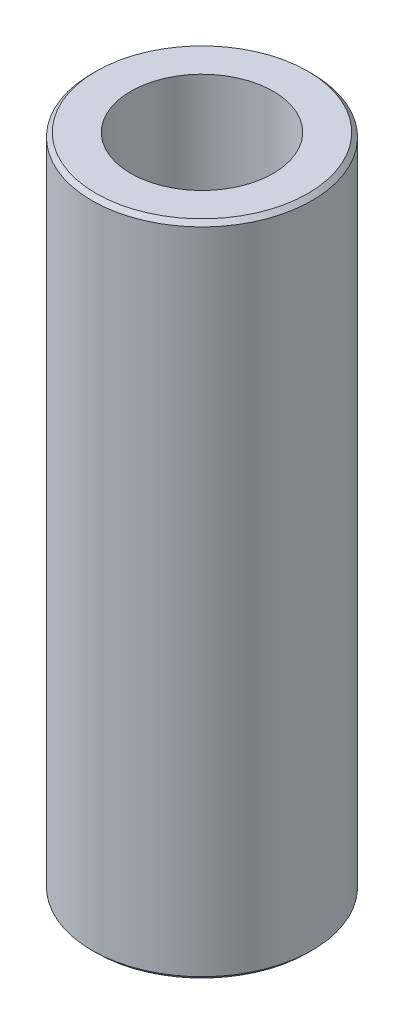
ISO-10303-21;
HEADER;
FILE_DESCRIPTION(('STEP AP214'),'2;1');
FILE_NAME('part.step','',(''),(''),'','','');
FILE_SCHEMA(('AUTOMOTIVE_DESIGN { 1 0 10303 214 1 1 1 1 }'));
ENDSEC;
DATA;
#1=APPLICATION_CONTEXT('core data for automotive mechanical design processes');
#2=APPLICATION_PROTOCOL_DEFINITION('international standard','automotive_design',2000,#1);
#3=PRODUCT_CONTEXT('',#1,'mechanical');
#4=PRODUCT('Part','Part','',(#3));
#5=PRODUCT_RELATED_PRODUCT_CATEGORY('part','',(#4));
#6=PRODUCT_DEFINITION_FORMATION('','',#4);
#7=PRODUCT_DEFINITION_CONTEXT('part definition',#1,'design');
#8=PRODUCT_DEFINITION('design','',#6,#7);
#9=PRODUCT_DEFINITION_SHAPE('','',#8);
#10=(LENGTH_UNIT() NAMED_UNIT(*) SI_UNIT(.MILLI.,.METRE.));
#11=(NAMED_UNIT(*) PLANE_ANGLE_UNIT() SI_UNIT($,.RADIAN.));
#12=(NAMED_UNIT(*) SI_UNIT($,.STERADIAN.) SOLID_ANGLE_UNIT());
#13=UNCERTAINTY_MEASURE_WITH_UNIT(LENGTH_MEASURE(1.E-05),#10,'distance_accuracy_value','');
#14=(GEOMETRIC_REPRESENTATION_CONTEXT(3) GLOBAL_UNCERTAINTY_ASSIGNED_CONTEXT((#13)) GLOBAL_UNIT_ASSIGNED_CONTEXT((#10,
#11,#12)) REPRESENTATION_CONTEXT('',''));
#15=CARTESIAN_POINT('',(0.,0.,0.));
#16=DIRECTION('',(0.,0.,1.));
#17=DIRECTION('',(1.,0.,0.));
#18=AXIS2_PLACEMENT_3D('',#15,#16,#17);
#19=CARTESIAN_POINT('',(0.,104.592380713921,0.));
#20=DIRECTION('',(0.,-1.,0.));
#21=DIRECTION('',(0.,0.,-1.));
#22=AXIS2_PLACEMENT_3D('',#19,#20,#21);
#23=CYLINDRICAL_SURFACE('',#22,17.5);
#24=CARTESIAN_POINT('',(0.,103.935720958625,0.));
#25=DIRECTION('',(0.,1.,0.));
#26=DIRECTION('',(0.,0.,1.));
#27=AXIS2_PLACEMENT_3D('',#24,#25,#26);
#28=CIRCLE('',#27,17.5);
#29=CARTESIAN_POINT('',(0.,103.935720958625,17.5));
#30=VERTEX_POINT('',#29);
#31=EDGE_CURVE('E50',#30,#30,#28,.F.);
#32=ORIENTED_EDGE('',*,*,#31,.T.);
#33=EDGE_LOOP('',(#32));
#34=FACE_BOUND('',#33,.T.);
#35=CARTESIAN_POINT('',(0.,0.656659755296274,0.));
#36=DIRECTION('',(0.,1.,0.));
#37=DIRECTION('',(0.,0.,1.));
#38=AXIS2_PLACEMENT_3D('',#35,#36,#37);
#39=CIRCLE('',#38,17.5);
#40=CARTESIAN_POINT('',(0.,0.656659755296274,17.5));
#41=VERTEX_POINT('',#40);
#42=EDGE_CURVE('E51',#41,#41,#39,.T.);
#43=ORIENTED_EDGE('',*,*,#42,.T.);
#44=EDGE_LOOP('',(#43));
#45=FACE_BOUND('',#44,.T.);
#46=ADVANCED_FACE('F39',(#34,#45),#23,.T.);
#47=CARTESIAN_POINT('',(0.,104.592380713921,0.));
#48=DIRECTION('',(0.,1.,0.));
#49=DIRECTION('',(0.,0.,1.));
#50=AXIS2_PLACEMENT_3D('',#47,#48,#49);
#51=PLANE('',#50);
#52=CARTESIAN_POINT('',(0.,104.592380713921,0.));
#53=DIRECTION('',(0.,1.,0.));
#54=DIRECTION('',(0.,0.,1.));
#55=AXIS2_PLACEMENT_3D('',#52,#53,#54);
#56=CIRCLE('',#55,16.8433402447037);
#57=CARTESIAN_POINT('',(0.,104.592380713921,16.8433402447037));
#58=VERTEX_POINT('',#57);
#59=EDGE_CURVE('E54',#58,#58,#56,.T.);
#60=ORIENTED_EDGE('',*,*,#59,.T.);
#61=EDGE_LOOP('',(#60));
#62=FACE_BOUND('',#61,.T.);
#63=CARTESIAN_POINT('',(0.,104.592380713921,0.));
#64=DIRECTION('',(0.,1.,0.));
#65=DIRECTION('',(0.,0.,1.));
#66=AXIS2_PLACEMENT_3D('',#63,#64,#65);
#67=CIRCLE('',#66,11.3308848933826);
#68=CARTESIAN_POINT('',(0.,104.592380713921,11.3308848933826));
#69=VERTEX_POINT('',#68);
#70=EDGE_CURVE('E58',#69,#69,#67,.T.);
#71=ORIENTED_EDGE('',*,*,#70,.F.);
#72=EDGE_LOOP('',(#71));
#73=FACE_BOUND('',#72,.T.);
#74=ADVANCED_FACE('F69',(#62,#73),#51,.T.);
#75=CARTESIAN_POINT('',(0.,0.,0.));
#76=DIRECTION('',(0.,1.,0.));
#77=DIRECTION('',(0.,0.,1.));
#78=AXIS2_PLACEMENT_3D('',#75,#76,#77);
#79=PLANE('',#78);
#80=CARTESIAN_POINT('',(0.,0.,0.));
#81=DIRECTION('',(0.,1.,0.));
#82=DIRECTION('',(0.,0.,1.));
#83=AXIS2_PLACEMENT_3D('',#80,#81,#82);
#84=CIRCLE('',#83,16.8433402447037);
#85=CARTESIAN_POINT('',(0.,0.,16.8433402447037));
#86=VERTEX_POINT('',#85);
#87=EDGE_CURVE('E10',#86,#86,#84,.F.);
#88=ORIENTED_EDGE('',*,*,#87,.T.);
#89=EDGE_LOOP('',(#88));
#90=FACE_BOUND('',#89,.T.);
#91=CARTESIAN_POINT('',(0.,0.,0.));
#92=DIRECTION('',(0.,1.,0.));
#93=DIRECTION('',(0.,0.,1.));
#94=AXIS2_PLACEMENT_3D('',#91,#92,#93);
#95=CIRCLE('',#94,11.3308848933826);
#96=CARTESIAN_POINT('',(0.,0.,11.3308848933826));
#97=VERTEX_POINT('',#96);
#98=EDGE_CURVE('E63',#97,#97,#95,.T.);
#99=ORIENTED_EDGE('',*,*,#98,.T.);
#100=EDGE_LOOP('',(#99));
#101=FACE_BOUND('',#100,.T.);
#102=ADVANCED_FACE('F75',(#90,#101),#79,.F.);
#103=CARTESIAN_POINT('',(0.,104.592380713921,0.));
#104=DIRECTION('',(0.,-1.,0.));
#105=DIRECTION('',(0.,0.,-1.));
#106=AXIS2_PLACEMENT_3D('',#103,#104,#105);
#107=CYLINDRICAL_SURFACE('',#106,11.3308848933826);
#108=ORIENTED_EDGE('',*,*,#70,.T.);
#109=EDGE_LOOP('',(#108));
#110=FACE_BOUND('',#109,.T.);
#111=ORIENTED_EDGE('',*,*,#98,.F.);
#112=EDGE_LOOP('',(#111));
#113=FACE_BOUND('',#112,.T.);
#114=ADVANCED_FACE('F70',(#110,#113),#107,.F.);
#115=CARTESIAN_POINT('',(0.,104.592380713921,0.));
#116=DIRECTION('',(0.,-1.,0.));
#117=DIRECTION('',(0.,0.,-1.));
#118=AXIS2_PLACEMENT_3D('',#115,#116,#117);
#119=CONICAL_SURFACE('',#118,16.8433402447037,0.78539816339744);
#120=ORIENTED_EDGE('',*,*,#31,.F.);
#121=EDGE_LOOP('',(#120));
#122=FACE_BOUND('',#121,.T.);
#123=ORIENTED_EDGE('',*,*,#59,.F.);
#124=EDGE_LOOP('',(#123));
#125=FACE_BOUND('',#124,.T.);
#126=ADVANCED_FACE('F81',(#122,#125),#119,.T.);
#127=CARTESIAN_POINT('',(0.,0.656659755296274,0.));
#128=DIRECTION('',(0.,1.,0.));
#129=DIRECTION('',(0.,0.,1.));
#130=AXIS2_PLACEMENT_3D('',#127,#128,#129);
#131=CONICAL_SURFACE('',#130,17.5,0.785398163397451);
#132=ORIENTED_EDGE('',*,*,#87,.F.);
#133=EDGE_LOOP('',(#132));
#134=FACE_BOUND('',#133,.T.);
#135=ORIENTED_EDGE('',*,*,#42,.F.);
#136=EDGE_LOOP('',(#135));
#137=FACE_BOUND('',#136,.T.);
#138=ADVANCED_FACE('F45',(#134,#137),#131,.T.);
#139=CLOSED_SHELL('',(#46,#74,#102,#114,#126,#138));
#140=MANIFOLD_SOLID_BREP('B2',#139);
#141=ADVANCED_BREP_SHAPE_REPRESENTATION('',(#18,#140),#14);
#142=SHAPE_DEFINITION_REPRESENTATION(#9,#141);
ENDSEC;
END-ISO-10303-21;
